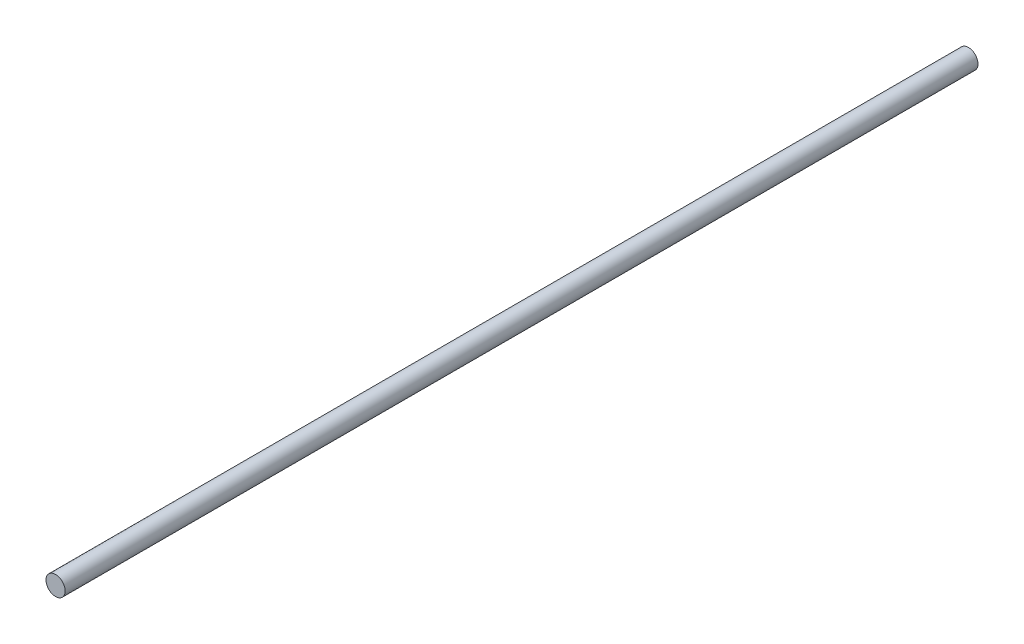
ISO-10303-21;
HEADER;
FILE_DESCRIPTION(('STEP AP214'),'2;1');
FILE_NAME('part.step','',(''),(''),'','','');
FILE_SCHEMA(('AUTOMOTIVE_DESIGN { 1 0 10303 214 1 1 1 1 }'));
ENDSEC;
DATA;
#1=APPLICATION_CONTEXT('core data for automotive mechanical design processes');
#2=APPLICATION_PROTOCOL_DEFINITION('international standard','automotive_design',2000,#1);
#3=PRODUCT_CONTEXT('',#1,'mechanical');
#4=PRODUCT('Part','Part','',(#3));
#5=PRODUCT_RELATED_PRODUCT_CATEGORY('part','',(#4));
#6=PRODUCT_DEFINITION_FORMATION('','',#4);
#7=PRODUCT_DEFINITION_CONTEXT('part definition',#1,'design');
#8=PRODUCT_DEFINITION('design','',#6,#7);
#9=PRODUCT_DEFINITION_SHAPE('','',#8);
#10=(LENGTH_UNIT() NAMED_UNIT(*) SI_UNIT(.MILLI.,.METRE.));
#11=(NAMED_UNIT(*) PLANE_ANGLE_UNIT() SI_UNIT($,.RADIAN.));
#12=(NAMED_UNIT(*) SI_UNIT($,.STERADIAN.) SOLID_ANGLE_UNIT());
#13=UNCERTAINTY_MEASURE_WITH_UNIT(LENGTH_MEASURE(1.E-05),#10,'distance_accuracy_value','');
#14=(GEOMETRIC_REPRESENTATION_CONTEXT(3) GLOBAL_UNCERTAINTY_ASSIGNED_CONTEXT((#13)) GLOBAL_UNIT_ASSIGNED_CONTEXT((#10,
#11,#12)) REPRESENTATION_CONTEXT('',''));
#15=CARTESIAN_POINT('',(0.,0.,0.));
#16=DIRECTION('',(0.,0.,1.));
#17=DIRECTION('',(1.,0.,0.));
#18=AXIS2_PLACEMENT_3D('',#15,#16,#17);
#19=CARTESIAN_POINT('',(0.,0.,381.));
#20=DIRECTION('',(0.,0.,-1.));
#21=DIRECTION('',(-1.,0.,0.));
#22=AXIS2_PLACEMENT_3D('',#19,#20,#21);
#23=CYLINDRICAL_SURFACE('',#22,4.);
#24=CARTESIAN_POINT('',(0.,0.,381.));
#25=DIRECTION('',(0.,0.,1.));
#26=DIRECTION('',(1.,0.,0.));
#27=AXIS2_PLACEMENT_3D('',#24,#25,#26);
#28=CIRCLE('',#27,4.);
#29=CARTESIAN_POINT('',(4.,0.,381.));
#30=VERTEX_POINT('',#29);
#31=EDGE_CURVE('E10',#30,#30,#28,.T.);
#32=ORIENTED_EDGE('',*,*,#31,.F.);
#33=EDGE_LOOP('',(#32));
#34=FACE_BOUND('',#33,.T.);
#35=CARTESIAN_POINT('',(0.,0.,0.));
#36=DIRECTION('',(0.,0.,1.));
#37=DIRECTION('',(1.,0.,0.));
#38=AXIS2_PLACEMENT_3D('',#35,#36,#37);
#39=CIRCLE('',#38,4.);
#40=CARTESIAN_POINT('',(4.,0.,0.));
#41=VERTEX_POINT('',#40);
#42=EDGE_CURVE('E33',#41,#41,#39,.T.);
#43=ORIENTED_EDGE('',*,*,#42,.T.);
#44=EDGE_LOOP('',(#43));
#45=FACE_BOUND('',#44,.T.);
#46=ADVANCED_FACE('F30',(#34,#45),#23,.T.);
#47=CARTESIAN_POINT('',(0.,0.,381.));
#48=DIRECTION('',(0.,0.,1.));
#49=DIRECTION('',(1.,0.,0.));
#50=AXIS2_PLACEMENT_3D('',#47,#48,#49);
#51=PLANE('',#50);
#52=ORIENTED_EDGE('',*,*,#31,.T.);
#53=EDGE_LOOP('',(#52));
#54=FACE_BOUND('',#53,.T.);
#55=ADVANCED_FACE('F45',(#54),#51,.T.);
#56=CARTESIAN_POINT('',(0.,0.,0.));
#57=DIRECTION('',(0.,0.,1.));
#58=DIRECTION('',(1.,0.,0.));
#59=AXIS2_PLACEMENT_3D('',#56,#57,#58);
#60=PLANE('',#59);
#61=ORIENTED_EDGE('',*,*,#42,.F.);
#62=EDGE_LOOP('',(#61));
#63=FACE_BOUND('',#62,.T.);
#64=ADVANCED_FACE('F43',(#63),#60,.F.);
#65=CLOSED_SHELL('',(#46,#55,#64));
#66=MANIFOLD_SOLID_BREP('B2',#65);
#67=ADVANCED_BREP_SHAPE_REPRESENTATION('',(#18,#66),#14);
#68=SHAPE_DEFINITION_REPRESENTATION(#9,#67);
ENDSEC;
END-ISO-10303-21;
